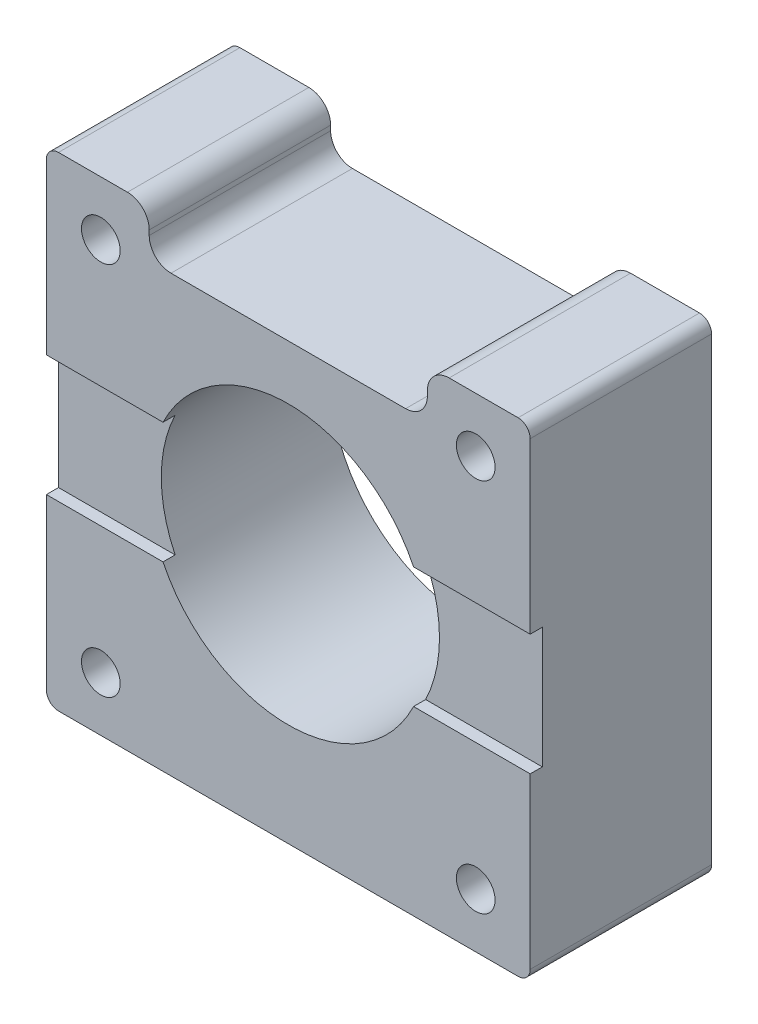
ISO-10303-21;
HEADER;
FILE_DESCRIPTION(('STEP AP214'),'2;1');
FILE_NAME('part.step','',(''),(''),'','','');
FILE_SCHEMA(('AUTOMOTIVE_DESIGN { 1 0 10303 214 1 1 1 1 }'));
ENDSEC;
DATA;
#1=APPLICATION_CONTEXT('core data for automotive mechanical design processes');
#2=APPLICATION_PROTOCOL_DEFINITION('international standard','automotive_design',2000,#1);
#3=PRODUCT_CONTEXT('',#1,'mechanical');
#4=PRODUCT('Part','Part','',(#3));
#5=PRODUCT_RELATED_PRODUCT_CATEGORY('part','',(#4));
#6=PRODUCT_DEFINITION_FORMATION('','',#4);
#7=PRODUCT_DEFINITION_CONTEXT('part definition',#1,'design');
#8=PRODUCT_DEFINITION('design','',#6,#7);
#9=PRODUCT_DEFINITION_SHAPE('','',#8);
#10=(LENGTH_UNIT() NAMED_UNIT(*) SI_UNIT(.MILLI.,.METRE.));
#11=(NAMED_UNIT(*) PLANE_ANGLE_UNIT() SI_UNIT($,.RADIAN.));
#12=(NAMED_UNIT(*) SI_UNIT($,.STERADIAN.) SOLID_ANGLE_UNIT());
#13=UNCERTAINTY_MEASURE_WITH_UNIT(LENGTH_MEASURE(1.E-05),#10,'distance_accuracy_value','');
#14=(GEOMETRIC_REPRESENTATION_CONTEXT(3) GLOBAL_UNCERTAINTY_ASSIGNED_CONTEXT((#13)) GLOBAL_UNIT_ASSIGNED_CONTEXT((#10,
#11,#12)) REPRESENTATION_CONTEXT('',''));
#15=CARTESIAN_POINT('',(0.,0.,0.));
#16=DIRECTION('',(0.,0.,1.));
#17=DIRECTION('',(1.,0.,0.));
#18=AXIS2_PLACEMENT_3D('',#15,#16,#17);
#19=CARTESIAN_POINT('',(-19.,-19.,15.));
#20=DIRECTION('',(0.,0.,1.));
#21=DIRECTION('',(1.,0.,0.));
#22=AXIS2_PLACEMENT_3D('',#19,#20,#21);
#23=PLANE('',#22);
#24=DIRECTION('',(1.,0.,0.));
#25=VECTOR('',#24,1.);
#26=CARTESIAN_POINT('',(-20.,-4.99999999999999,15.));
#27=LINE('',#26,#25);
#28=CARTESIAN_POINT('',(-20.,-4.99999999999999,15.));
#29=VERTEX_POINT('',#28);
#30=CARTESIAN_POINT('',(-10.356157588604,-4.99999999999999,15.));
#31=VERTEX_POINT('',#30);
#32=EDGE_CURVE('E208',#29,#31,#27,.T.);
#33=ORIENTED_EDGE('',*,*,#32,.F.);
#34=DIRECTION('',(0.,-1.,0.));
#35=VECTOR('',#34,1.);
#36=CARTESIAN_POINT('',(-20.,19.,15.));
#37=LINE('',#36,#35);
#38=CARTESIAN_POINT('',(-20.,-19.,15.));
#39=VERTEX_POINT('',#38);
#40=EDGE_CURVE('E288',#29,#39,#37,.T.);
#41=ORIENTED_EDGE('',*,*,#40,.T.);
#42=CARTESIAN_POINT('',(-19.,-19.,15.));
#43=DIRECTION('',(0.,0.,1.));
#44=DIRECTION('',(1.,0.,0.));
#45=AXIS2_PLACEMENT_3D('',#42,#43,#44);
#46=CIRCLE('',#45,1.);
#47=CARTESIAN_POINT('',(-19.,-20.,15.));
#48=VERTEX_POINT('',#47);
#49=EDGE_CURVE('E255',#39,#48,#46,.T.);
#50=ORIENTED_EDGE('',*,*,#49,.T.);
#51=DIRECTION('',(1.,0.,0.));
#52=VECTOR('',#51,1.);
#53=CARTESIAN_POINT('',(-19.,-20.,15.));
#54=LINE('',#53,#52);
#55=CARTESIAN_POINT('',(19.,-20.,15.));
#56=VERTEX_POINT('',#55);
#57=EDGE_CURVE('E258',#48,#56,#54,.T.);
#58=ORIENTED_EDGE('',*,*,#57,.T.);
#59=CARTESIAN_POINT('',(19.,-19.,15.));
#60=DIRECTION('',(0.,0.,1.));
#61=DIRECTION('',(1.,0.,0.));
#62=AXIS2_PLACEMENT_3D('',#59,#60,#61);
#63=CIRCLE('',#62,1.);
#64=CARTESIAN_POINT('',(20.,-19.,15.));
#65=VERTEX_POINT('',#64);
#66=EDGE_CURVE('E261',#56,#65,#63,.T.);
#67=ORIENTED_EDGE('',*,*,#66,.T.);
#68=DIRECTION('',(0.,1.,0.));
#69=VECTOR('',#68,1.);
#70=CARTESIAN_POINT('',(20.,19.,15.));
#71=LINE('',#70,#69);
#72=CARTESIAN_POINT('',(20.,-4.99999999999999,15.));
#73=VERTEX_POINT('',#72);
#74=EDGE_CURVE('E263',#65,#73,#71,.T.);
#75=ORIENTED_EDGE('',*,*,#74,.T.);
#76=CARTESIAN_POINT('',(10.356157588604,-4.99999999999999,15.));
#77=VERTEX_POINT('',#76);
#78=EDGE_CURVE('E392',#77,#73,#27,.T.);
#79=ORIENTED_EDGE('',*,*,#78,.F.);
#80=CARTESIAN_POINT('',(0.,0.,15.));
#81=DIRECTION('',(0.,0.,1.));
#82=DIRECTION('',(1.,0.,0.));
#83=AXIS2_PLACEMENT_3D('',#80,#81,#82);
#84=CIRCLE('',#83,11.5);
#85=EDGE_CURVE('E252',#31,#77,#84,.T.);
#86=ORIENTED_EDGE('',*,*,#85,.F.);
#87=EDGE_LOOP('',(#33,#41,#50,#58,#67,#75,#79,#86));
#88=FACE_BOUND('',#87,.T.);
#89=CARTESIAN_POINT('',(-15.5,-15.5,15.));
#90=DIRECTION('',(0.,0.,1.));
#91=DIRECTION('',(1.,0.,0.));
#92=AXIS2_PLACEMENT_3D('',#89,#90,#91);
#93=CIRCLE('',#92,1.6);
#94=CARTESIAN_POINT('',(-13.9,-15.5,15.));
#95=VERTEX_POINT('',#94);
#96=EDGE_CURVE('E222',#95,#95,#93,.T.);
#97=ORIENTED_EDGE('',*,*,#96,.F.);
#98=EDGE_LOOP('',(#97));
#99=FACE_BOUND('',#98,.T.);
#100=CARTESIAN_POINT('',(15.5,-15.5,15.));
#101=DIRECTION('',(0.,0.,1.));
#102=DIRECTION('',(1.,0.,0.));
#103=AXIS2_PLACEMENT_3D('',#100,#101,#102);
#104=CIRCLE('',#103,1.6);
#105=CARTESIAN_POINT('',(17.1,-15.5,15.));
#106=VERTEX_POINT('',#105);
#107=EDGE_CURVE('E230',#106,#106,#104,.T.);
#108=ORIENTED_EDGE('',*,*,#107,.F.);
#109=EDGE_LOOP('',(#108));
#110=FACE_BOUND('',#109,.T.);
#111=ADVANCED_FACE('F33',(#88,#99,#110),#23,.T.);
#112=DIRECTION('',(-1.,0.,0.));
#113=VECTOR('',#112,1.);
#114=CARTESIAN_POINT('',(-20.,5.00000000000001,15.));
#115=LINE('',#114,#113);
#116=CARTESIAN_POINT('',(20.,5.00000000000001,15.));
#117=VERTEX_POINT('',#116);
#118=CARTESIAN_POINT('',(10.356157588604,5.00000000000001,15.));
#119=VERTEX_POINT('',#118);
#120=EDGE_CURVE('E394',#117,#119,#115,.T.);
#121=ORIENTED_EDGE('',*,*,#120,.F.);
#122=CARTESIAN_POINT('',(20.,19.,15.));
#123=VERTEX_POINT('',#122);
#124=EDGE_CURVE('E213',#117,#123,#71,.T.);
#125=ORIENTED_EDGE('',*,*,#124,.T.);
#126=CARTESIAN_POINT('',(19.,19.,15.));
#127=DIRECTION('',(0.,0.,1.));
#128=DIRECTION('',(1.,0.,0.));
#129=AXIS2_PLACEMENT_3D('',#126,#127,#128);
#130=CIRCLE('',#129,1.);
#131=CARTESIAN_POINT('',(19.,20.,15.));
#132=VERTEX_POINT('',#131);
#133=EDGE_CURVE('E266',#123,#132,#130,.T.);
#134=ORIENTED_EDGE('',*,*,#133,.T.);
#135=DIRECTION('',(-1.,0.,0.));
#136=VECTOR('',#135,1.);
#137=CARTESIAN_POINT('',(13.3,20.,15.));
#138=LINE('',#137,#136);
#139=CARTESIAN_POINT('',(13.3,20.,15.));
#140=VERTEX_POINT('',#139);
#141=EDGE_CURVE('E268',#132,#140,#138,.T.);
#142=ORIENTED_EDGE('',*,*,#141,.T.);
#143=CARTESIAN_POINT('',(13.3,18.2,15.));
#144=DIRECTION('',(0.,0.,1.));
#145=DIRECTION('',(1.,0.,0.));
#146=AXIS2_PLACEMENT_3D('',#143,#144,#145);
#147=CIRCLE('',#146,1.8);
#148=CARTESIAN_POINT('',(11.5,18.2,15.));
#149=VERTEX_POINT('',#148);
#150=EDGE_CURVE('E270',#140,#149,#147,.T.);
#151=ORIENTED_EDGE('',*,*,#150,.T.);
#152=DIRECTION('',(0.,-1.,0.));
#153=VECTOR('',#152,1.);
#154=CARTESIAN_POINT('',(11.5,17.8,15.));
#155=LINE('',#154,#153);
#156=CARTESIAN_POINT('',(11.5,17.8,15.));
#157=VERTEX_POINT('',#156);
#158=EDGE_CURVE('E272',#149,#157,#155,.T.);
#159=ORIENTED_EDGE('',*,*,#158,.T.);
#160=CARTESIAN_POINT('',(9.7,17.8,15.));
#161=DIRECTION('',(0.,0.,-1.));
#162=DIRECTION('',(-1.,0.,0.));
#163=AXIS2_PLACEMENT_3D('',#160,#161,#162);
#164=CIRCLE('',#163,1.8);
#165=CARTESIAN_POINT('',(9.69999999999999,16.,15.));
#166=VERTEX_POINT('',#165);
#167=EDGE_CURVE('E274',#157,#166,#164,.T.);
#168=ORIENTED_EDGE('',*,*,#167,.T.);
#169=DIRECTION('',(-1.,0.,0.));
#170=VECTOR('',#169,1.);
#171=CARTESIAN_POINT('',(-9.69999999999999,16.,15.));
#172=LINE('',#171,#170);
#173=CARTESIAN_POINT('',(-9.69999999999999,16.,15.));
#174=VERTEX_POINT('',#173);
#175=EDGE_CURVE('E276',#166,#174,#172,.T.);
#176=ORIENTED_EDGE('',*,*,#175,.T.);
#177=CARTESIAN_POINT('',(-9.7,17.8,15.));
#178=DIRECTION('',(0.,0.,-1.));
#179=DIRECTION('',(-1.,0.,0.));
#180=AXIS2_PLACEMENT_3D('',#177,#178,#179);
#181=CIRCLE('',#180,1.8);
#182=CARTESIAN_POINT('',(-11.5,17.8,15.));
#183=VERTEX_POINT('',#182);
#184=EDGE_CURVE('E278',#174,#183,#181,.T.);
#185=ORIENTED_EDGE('',*,*,#184,.T.);
#186=DIRECTION('',(0.,1.,0.));
#187=VECTOR('',#186,1.);
#188=CARTESIAN_POINT('',(-11.5,17.8,15.));
#189=LINE('',#188,#187);
#190=CARTESIAN_POINT('',(-11.5,18.2,15.));
#191=VERTEX_POINT('',#190);
#192=EDGE_CURVE('E280',#183,#191,#189,.T.);
#193=ORIENTED_EDGE('',*,*,#192,.T.);
#194=CARTESIAN_POINT('',(-13.3,18.2,15.));
#195=DIRECTION('',(0.,0.,1.));
#196=DIRECTION('',(-1.,0.,0.));
#197=AXIS2_PLACEMENT_3D('',#194,#195,#196);
#198=CIRCLE('',#197,1.8);
#199=CARTESIAN_POINT('',(-13.3,20.,15.));
#200=VERTEX_POINT('',#199);
#201=EDGE_CURVE('E282',#191,#200,#198,.T.);
#202=ORIENTED_EDGE('',*,*,#201,.T.);
#203=DIRECTION('',(-1.,0.,0.));
#204=VECTOR('',#203,1.);
#205=CARTESIAN_POINT('',(-19.,20.,15.));
#206=LINE('',#205,#204);
#207=CARTESIAN_POINT('',(-19.,20.,15.));
#208=VERTEX_POINT('',#207);
#209=EDGE_CURVE('E284',#200,#208,#206,.T.);
#210=ORIENTED_EDGE('',*,*,#209,.T.);
#211=CARTESIAN_POINT('',(-19.,19.,15.));
#212=DIRECTION('',(0.,0.,1.));
#213=DIRECTION('',(-1.,0.,0.));
#214=AXIS2_PLACEMENT_3D('',#211,#212,#213);
#215=CIRCLE('',#214,1.);
#216=CARTESIAN_POINT('',(-20.,19.,15.));
#217=VERTEX_POINT('',#216);
#218=EDGE_CURVE('E286',#208,#217,#215,.T.);
#219=ORIENTED_EDGE('',*,*,#218,.T.);
#220=CARTESIAN_POINT('',(-20.,5.00000000000001,15.));
#221=VERTEX_POINT('',#220);
#222=EDGE_CURVE('E289',#217,#221,#37,.T.);
#223=ORIENTED_EDGE('',*,*,#222,.T.);
#224=CARTESIAN_POINT('',(-10.356157588604,5.00000000000001,15.));
#225=VERTEX_POINT('',#224);
#226=EDGE_CURVE('E396',#225,#221,#115,.T.);
#227=ORIENTED_EDGE('',*,*,#226,.F.);
#228=EDGE_CURVE('E248',#119,#225,#84,.T.);
#229=ORIENTED_EDGE('',*,*,#228,.F.);
#230=EDGE_LOOP('',(#121,#125,#134,#142,#151,#159,#168,#176,#185,#193,#202,#210,#219,#223,#227,#229));
#231=FACE_BOUND('',#230,.T.);
#232=CARTESIAN_POINT('',(-15.5,15.5,15.));
#233=DIRECTION('',(0.,0.,1.));
#234=DIRECTION('',(1.,0.,0.));
#235=AXIS2_PLACEMENT_3D('',#232,#233,#234);
#236=CIRCLE('',#235,1.6);
#237=CARTESIAN_POINT('',(-13.9,15.5,15.));
#238=VERTEX_POINT('',#237);
#239=EDGE_CURVE('E242',#238,#238,#236,.T.);
#240=ORIENTED_EDGE('',*,*,#239,.F.);
#241=EDGE_LOOP('',(#240));
#242=FACE_BOUND('',#241,.T.);
#243=CARTESIAN_POINT('',(15.5,15.5,15.));
#244=DIRECTION('',(0.,0.,1.));
#245=DIRECTION('',(1.,0.,0.));
#246=AXIS2_PLACEMENT_3D('',#243,#244,#245);
#247=CIRCLE('',#246,1.6);
#248=CARTESIAN_POINT('',(17.1,15.5,15.));
#249=VERTEX_POINT('',#248);
#250=EDGE_CURVE('E236',#249,#249,#247,.T.);
#251=ORIENTED_EDGE('',*,*,#250,.F.);
#252=EDGE_LOOP('',(#251));
#253=FACE_BOUND('',#252,.T.);
#254=ADVANCED_FACE('F435',(#231,#242,#253),#23,.T.);
#255=CARTESIAN_POINT('',(-19.,-19.,0.));
#256=DIRECTION('',(0.,0.,1.));
#257=DIRECTION('',(1.,0.,0.));
#258=AXIS2_PLACEMENT_3D('',#255,#256,#257);
#259=PLANE('',#258);
#260=CARTESIAN_POINT('',(15.5,-15.5,0.));
#261=DIRECTION('',(0.,0.,1.));
#262=DIRECTION('',(1.,0.,0.));
#263=AXIS2_PLACEMENT_3D('',#260,#261,#262);
#264=CIRCLE('',#263,1.6);
#265=CARTESIAN_POINT('',(17.1,-15.5,0.));
#266=VERTEX_POINT('',#265);
#267=EDGE_CURVE('E225',#266,#266,#264,.T.);
#268=ORIENTED_EDGE('',*,*,#267,.T.);
#269=EDGE_LOOP('',(#268));
#270=FACE_BOUND('',#269,.T.);
#271=CARTESIAN_POINT('',(-15.5,15.5,0.));
#272=DIRECTION('',(0.,0.,1.));
#273=DIRECTION('',(1.,0.,0.));
#274=AXIS2_PLACEMENT_3D('',#271,#272,#273);
#275=CIRCLE('',#274,1.6);
#276=CARTESIAN_POINT('',(-13.9,15.5,0.));
#277=VERTEX_POINT('',#276);
#278=EDGE_CURVE('E239',#277,#277,#275,.T.);
#279=ORIENTED_EDGE('',*,*,#278,.T.);
#280=EDGE_LOOP('',(#279));
#281=FACE_BOUND('',#280,.T.);
#282=CARTESIAN_POINT('',(-19.,-19.,0.));
#283=DIRECTION('',(0.,0.,1.));
#284=DIRECTION('',(1.,0.,0.));
#285=AXIS2_PLACEMENT_3D('',#282,#283,#284);
#286=CIRCLE('',#285,1.);
#287=CARTESIAN_POINT('',(-20.,-19.,0.));
#288=VERTEX_POINT('',#287);
#289=CARTESIAN_POINT('',(-19.,-20.,0.));
#290=VERTEX_POINT('',#289);
#291=EDGE_CURVE('E251',#288,#290,#286,.T.);
#292=ORIENTED_EDGE('',*,*,#291,.F.);
#293=DIRECTION('',(0.,-1.,0.));
#294=VECTOR('',#293,1.);
#295=CARTESIAN_POINT('',(-20.,19.,0.));
#296=LINE('',#295,#294);
#297=CARTESIAN_POINT('',(-20.,19.,0.));
#298=VERTEX_POINT('',#297);
#299=EDGE_CURVE('E259',#298,#288,#296,.T.);
#300=ORIENTED_EDGE('',*,*,#299,.F.);
#301=CARTESIAN_POINT('',(-19.,19.,0.));
#302=DIRECTION('',(0.,0.,1.));
#303=DIRECTION('',(-1.,0.,0.));
#304=AXIS2_PLACEMENT_3D('',#301,#302,#303);
#305=CIRCLE('',#304,1.);
#306=CARTESIAN_POINT('',(-19.,20.,0.));
#307=VERTEX_POINT('',#306);
#308=EDGE_CURVE('E321',#307,#298,#305,.T.);
#309=ORIENTED_EDGE('',*,*,#308,.F.);
#310=DIRECTION('',(-1.,0.,0.));
#311=VECTOR('',#310,1.);
#312=CARTESIAN_POINT('',(-19.,20.,0.));
#313=LINE('',#312,#311);
#314=CARTESIAN_POINT('',(-13.3,20.,0.));
#315=VERTEX_POINT('',#314);
#316=EDGE_CURVE('E319',#315,#307,#313,.T.);
#317=ORIENTED_EDGE('',*,*,#316,.F.);
#318=CARTESIAN_POINT('',(-13.3,18.2,0.));
#319=DIRECTION('',(0.,0.,1.));
#320=DIRECTION('',(-1.,0.,0.));
#321=AXIS2_PLACEMENT_3D('',#318,#319,#320);
#322=CIRCLE('',#321,1.8);
#323=CARTESIAN_POINT('',(-11.5,18.2,0.));
#324=VERTEX_POINT('',#323);
#325=EDGE_CURVE('E317',#324,#315,#322,.T.);
#326=ORIENTED_EDGE('',*,*,#325,.F.);
#327=DIRECTION('',(0.,1.,0.));
#328=VECTOR('',#327,1.);
#329=CARTESIAN_POINT('',(-11.5,17.8,0.));
#330=LINE('',#329,#328);
#331=CARTESIAN_POINT('',(-11.5,17.8,0.));
#332=VERTEX_POINT('',#331);
#333=EDGE_CURVE('E315',#332,#324,#330,.T.);
#334=ORIENTED_EDGE('',*,*,#333,.F.);
#335=CARTESIAN_POINT('',(-9.7,17.8,0.));
#336=DIRECTION('',(0.,0.,-1.));
#337=DIRECTION('',(-1.,0.,0.));
#338=AXIS2_PLACEMENT_3D('',#335,#336,#337);
#339=CIRCLE('',#338,1.8);
#340=CARTESIAN_POINT('',(-9.69999999999999,16.,0.));
#341=VERTEX_POINT('',#340);
#342=EDGE_CURVE('E313',#341,#332,#339,.T.);
#343=ORIENTED_EDGE('',*,*,#342,.F.);
#344=DIRECTION('',(-1.,0.,0.));
#345=VECTOR('',#344,1.);
#346=CARTESIAN_POINT('',(-9.69999999999999,16.,0.));
#347=LINE('',#346,#345);
#348=CARTESIAN_POINT('',(9.69999999999999,16.,0.));
#349=VERTEX_POINT('',#348);
#350=EDGE_CURVE('E311',#349,#341,#347,.T.);
#351=ORIENTED_EDGE('',*,*,#350,.F.);
#352=CARTESIAN_POINT('',(9.7,17.8,0.));
#353=DIRECTION('',(0.,0.,-1.));
#354=DIRECTION('',(-1.,0.,0.));
#355=AXIS2_PLACEMENT_3D('',#352,#353,#354);
#356=CIRCLE('',#355,1.8);
#357=CARTESIAN_POINT('',(11.5,17.8,0.));
#358=VERTEX_POINT('',#357);
#359=EDGE_CURVE('E309',#358,#349,#356,.T.);
#360=ORIENTED_EDGE('',*,*,#359,.F.);
#361=DIRECTION('',(0.,-1.,0.));
#362=VECTOR('',#361,1.);
#363=CARTESIAN_POINT('',(11.5,17.8,0.));
#364=LINE('',#363,#362);
#365=CARTESIAN_POINT('',(11.5,18.2,0.));
#366=VERTEX_POINT('',#365);
#367=EDGE_CURVE('E307',#366,#358,#364,.T.);
#368=ORIENTED_EDGE('',*,*,#367,.F.);
#369=CARTESIAN_POINT('',(13.3,18.2,0.));
#370=DIRECTION('',(0.,0.,1.));
#371=DIRECTION('',(1.,0.,0.));
#372=AXIS2_PLACEMENT_3D('',#369,#370,#371);
#373=CIRCLE('',#372,1.8);
#374=CARTESIAN_POINT('',(13.3,20.,0.));
#375=VERTEX_POINT('',#374);
#376=EDGE_CURVE('E305',#375,#366,#373,.T.);
#377=ORIENTED_EDGE('',*,*,#376,.F.);
#378=DIRECTION('',(-1.,0.,0.));
#379=VECTOR('',#378,1.);
#380=CARTESIAN_POINT('',(13.3,20.,0.));
#381=LINE('',#380,#379);
#382=CARTESIAN_POINT('',(19.,20.,0.));
#383=VERTEX_POINT('',#382);
#384=EDGE_CURVE('E303',#383,#375,#381,.T.);
#385=ORIENTED_EDGE('',*,*,#384,.F.);
#386=CARTESIAN_POINT('',(19.,19.,0.));
#387=DIRECTION('',(0.,0.,1.));
#388=DIRECTION('',(1.,0.,0.));
#389=AXIS2_PLACEMENT_3D('',#386,#387,#388);
#390=CIRCLE('',#389,1.);
#391=CARTESIAN_POINT('',(20.,19.,0.));
#392=VERTEX_POINT('',#391);
#393=EDGE_CURVE('E301',#392,#383,#390,.T.);
#394=ORIENTED_EDGE('',*,*,#393,.F.);
#395=DIRECTION('',(0.,1.,0.));
#396=VECTOR('',#395,1.);
#397=CARTESIAN_POINT('',(20.,19.,0.));
#398=LINE('',#397,#396);
#399=CARTESIAN_POINT('',(20.,-19.,0.));
#400=VERTEX_POINT('',#399);
#401=EDGE_CURVE('E299',#400,#392,#398,.T.);
#402=ORIENTED_EDGE('',*,*,#401,.F.);
#403=CARTESIAN_POINT('',(19.,-19.,0.));
#404=DIRECTION('',(0.,0.,1.));
#405=DIRECTION('',(1.,0.,0.));
#406=AXIS2_PLACEMENT_3D('',#403,#404,#405);
#407=CIRCLE('',#406,1.);
#408=CARTESIAN_POINT('',(19.,-20.,0.));
#409=VERTEX_POINT('',#408);
#410=EDGE_CURVE('E297',#409,#400,#407,.T.);
#411=ORIENTED_EDGE('',*,*,#410,.F.);
#412=DIRECTION('',(1.,0.,0.));
#413=VECTOR('',#412,1.);
#414=CARTESIAN_POINT('',(-19.,-20.,0.));
#415=LINE('',#414,#413);
#416=EDGE_CURVE('E295',#290,#409,#415,.T.);
#417=ORIENTED_EDGE('',*,*,#416,.F.);
#418=EDGE_LOOP('',(#292,#300,#309,#317,#326,#334,#343,#351,#360,#368,#377,#385,#394,#402,#411,#417));
#419=FACE_BOUND('',#418,.T.);
#420=CARTESIAN_POINT('',(0.,0.,0.));
#421=DIRECTION('',(0.,0.,1.));
#422=DIRECTION('',(1.,0.,0.));
#423=AXIS2_PLACEMENT_3D('',#420,#421,#422);
#424=CIRCLE('',#423,11.5);
#425=CARTESIAN_POINT('',(11.5,0.,0.));
#426=VERTEX_POINT('',#425);
#427=EDGE_CURVE('E245',#426,#426,#424,.T.);
#428=ORIENTED_EDGE('',*,*,#427,.T.);
#429=EDGE_LOOP('',(#428));
#430=FACE_BOUND('',#429,.T.);
#431=CARTESIAN_POINT('',(15.5,15.5,0.));
#432=DIRECTION('',(0.,0.,1.));
#433=DIRECTION('',(1.,0.,0.));
#434=AXIS2_PLACEMENT_3D('',#431,#432,#433);
#435=CIRCLE('',#434,1.6);
#436=CARTESIAN_POINT('',(17.1,15.5,0.));
#437=VERTEX_POINT('',#436);
#438=EDGE_CURVE('E233',#437,#437,#435,.T.);
#439=ORIENTED_EDGE('',*,*,#438,.T.);
#440=EDGE_LOOP('',(#439));
#441=FACE_BOUND('',#440,.T.);
#442=CARTESIAN_POINT('',(-15.5,-15.5,0.));
#443=DIRECTION('',(0.,0.,1.));
#444=DIRECTION('',(1.,0.,0.));
#445=AXIS2_PLACEMENT_3D('',#442,#443,#444);
#446=CIRCLE('',#445,1.6);
#447=CARTESIAN_POINT('',(-13.9,-15.5,0.));
#448=VERTEX_POINT('',#447);
#449=EDGE_CURVE('E226',#448,#448,#446,.T.);
#450=ORIENTED_EDGE('',*,*,#449,.T.);
#451=EDGE_LOOP('',(#450));
#452=FACE_BOUND('',#451,.T.);
#453=ADVANCED_FACE('F421',(#270,#281,#419,#430,#441,#452),#259,.F.);
#454=CARTESIAN_POINT('',(-19.,-19.,15.));
#455=DIRECTION('',(0.,0.,-1.));
#456=DIRECTION('',(-1.,0.,0.));
#457=AXIS2_PLACEMENT_3D('',#454,#455,#456);
#458=CYLINDRICAL_SURFACE('',#457,1.);
#459=ORIENTED_EDGE('',*,*,#291,.T.);
#460=DIRECTION('',(0.,0.,-1.));
#461=VECTOR('',#460,1.);
#462=CARTESIAN_POINT('',(-19.,-20.,15.));
#463=LINE('',#462,#461);
#464=EDGE_CURVE('E368',#48,#290,#463,.T.);
#465=ORIENTED_EDGE('',*,*,#464,.F.);
#466=ORIENTED_EDGE('',*,*,#49,.F.);
#467=DIRECTION('',(0.,0.,-1.));
#468=VECTOR('',#467,1.);
#469=CARTESIAN_POINT('',(-20.,-19.,15.));
#470=LINE('',#469,#468);
#471=EDGE_CURVE('E292',#39,#288,#470,.T.);
#472=ORIENTED_EDGE('',*,*,#471,.T.);
#473=EDGE_LOOP('',(#459,#465,#466,#472));
#474=FACE_BOUND('',#473,.T.);
#475=ADVANCED_FACE('F35',(#474),#458,.T.);
#476=CARTESIAN_POINT('',(-19.,-20.,15.));
#477=DIRECTION('',(0.,1.,0.));
#478=DIRECTION('',(0.,0.,1.));
#479=AXIS2_PLACEMENT_3D('',#476,#477,#478);
#480=PLANE('',#479);
#481=ORIENTED_EDGE('',*,*,#416,.T.);
#482=DIRECTION('',(0.,0.,-1.));
#483=VECTOR('',#482,1.);
#484=CARTESIAN_POINT('',(19.,-20.,15.));
#485=LINE('',#484,#483);
#486=EDGE_CURVE('E365',#56,#409,#485,.T.);
#487=ORIENTED_EDGE('',*,*,#486,.F.);
#488=ORIENTED_EDGE('',*,*,#57,.F.);
#489=ORIENTED_EDGE('',*,*,#464,.T.);
#490=EDGE_LOOP('',(#481,#487,#488,#489));
#491=FACE_BOUND('',#490,.T.);
#492=ADVANCED_FACE('F412',(#491),#480,.F.);
#493=CARTESIAN_POINT('',(19.,-19.,15.));
#494=DIRECTION('',(0.,0.,-1.));
#495=DIRECTION('',(-1.,0.,0.));
#496=AXIS2_PLACEMENT_3D('',#493,#494,#495);
#497=CYLINDRICAL_SURFACE('',#496,1.);
#498=ORIENTED_EDGE('',*,*,#410,.T.);
#499=DIRECTION('',(0.,0.,-1.));
#500=VECTOR('',#499,1.);
#501=CARTESIAN_POINT('',(20.,-19.,15.));
#502=LINE('',#501,#500);
#503=EDGE_CURVE('E362',#65,#400,#502,.T.);
#504=ORIENTED_EDGE('',*,*,#503,.F.);
#505=ORIENTED_EDGE('',*,*,#66,.F.);
#506=ORIENTED_EDGE('',*,*,#486,.T.);
#507=EDGE_LOOP('',(#498,#504,#505,#506));
#508=FACE_BOUND('',#507,.T.);
#509=ADVANCED_FACE('F417',(#508),#497,.T.);
#510=CARTESIAN_POINT('',(20.,19.,15.));
#511=DIRECTION('',(-1.,0.,0.));
#512=DIRECTION('',(0.,0.,1.));
#513=AXIS2_PLACEMENT_3D('',#510,#511,#512);
#514=PLANE('',#513);
#515=DIRECTION('',(0.,1.,0.));
#516=VECTOR('',#515,1.);
#517=CARTESIAN_POINT('',(20.,-4.99999999999999,14.));
#518=LINE('',#517,#516);
#519=CARTESIAN_POINT('',(20.,-4.99999999999999,14.));
#520=VERTEX_POINT('',#519);
#521=CARTESIAN_POINT('',(20.,5.00000000000001,14.));
#522=VERTEX_POINT('',#521);
#523=EDGE_CURVE('E201',#520,#522,#518,.T.);
#524=ORIENTED_EDGE('',*,*,#523,.F.);
#525=DIRECTION('',(0.,0.,1.));
#526=VECTOR('',#525,1.);
#527=CARTESIAN_POINT('',(20.,-4.99999999999999,14.));
#528=LINE('',#527,#526);
#529=EDGE_CURVE('E229',#520,#73,#528,.T.);
#530=ORIENTED_EDGE('',*,*,#529,.T.);
#531=ORIENTED_EDGE('',*,*,#74,.F.);
#532=ORIENTED_EDGE('',*,*,#503,.T.);
#533=ORIENTED_EDGE('',*,*,#401,.T.);
#534=DIRECTION('',(0.,0.,-1.));
#535=VECTOR('',#534,1.);
#536=CARTESIAN_POINT('',(20.,19.,15.));
#537=LINE('',#536,#535);
#538=EDGE_CURVE('E359',#123,#392,#537,.T.);
#539=ORIENTED_EDGE('',*,*,#538,.F.);
#540=ORIENTED_EDGE('',*,*,#124,.F.);
#541=DIRECTION('',(0.,0.,1.));
#542=VECTOR('',#541,1.);
#543=CARTESIAN_POINT('',(20.,5.00000000000001,14.));
#544=LINE('',#543,#542);
#545=EDGE_CURVE('E193',#522,#117,#544,.T.);
#546=ORIENTED_EDGE('',*,*,#545,.F.);
#547=EDGE_LOOP('',(#524,#530,#531,#532,#533,#539,#540,#546));
#548=FACE_BOUND('',#547,.T.);
#549=ADVANCED_FACE('F211',(#548),#514,.F.);
#550=CARTESIAN_POINT('',(19.,19.,15.));
#551=DIRECTION('',(0.,0.,-1.));
#552=DIRECTION('',(-1.,0.,0.));
#553=AXIS2_PLACEMENT_3D('',#550,#551,#552);
#554=CYLINDRICAL_SURFACE('',#553,1.);
#555=ORIENTED_EDGE('',*,*,#393,.T.);
#556=DIRECTION('',(0.,0.,-1.));
#557=VECTOR('',#556,1.);
#558=CARTESIAN_POINT('',(19.,20.,15.));
#559=LINE('',#558,#557);
#560=EDGE_CURVE('E356',#132,#383,#559,.T.);
#561=ORIENTED_EDGE('',*,*,#560,.F.);
#562=ORIENTED_EDGE('',*,*,#133,.F.);
#563=ORIENTED_EDGE('',*,*,#538,.T.);
#564=EDGE_LOOP('',(#555,#561,#562,#563));
#565=FACE_BOUND('',#564,.T.);
#566=ADVANCED_FACE('F427',(#565),#554,.T.);
#567=CARTESIAN_POINT('',(13.3,20.,15.));
#568=DIRECTION('',(0.,-1.,0.));
#569=DIRECTION('',(0.,0.,-1.));
#570=AXIS2_PLACEMENT_3D('',#567,#568,#569);
#571=PLANE('',#570);
#572=ORIENTED_EDGE('',*,*,#384,.T.);
#573=DIRECTION('',(0.,0.,-1.));
#574=VECTOR('',#573,1.);
#575=CARTESIAN_POINT('',(13.3,20.,15.));
#576=LINE('',#575,#574);
#577=EDGE_CURVE('E353',#140,#375,#576,.T.);
#578=ORIENTED_EDGE('',*,*,#577,.F.);
#579=ORIENTED_EDGE('',*,*,#141,.F.);
#580=ORIENTED_EDGE('',*,*,#560,.T.);
#581=EDGE_LOOP('',(#572,#578,#579,#580));
#582=FACE_BOUND('',#581,.T.);
#583=ADVANCED_FACE('F431',(#582),#571,.F.);
#584=CARTESIAN_POINT('',(13.3,18.2,15.));
#585=DIRECTION('',(0.,0.,-1.));
#586=DIRECTION('',(-1.,0.,0.));
#587=AXIS2_PLACEMENT_3D('',#584,#585,#586);
#588=CYLINDRICAL_SURFACE('',#587,1.8);
#589=ORIENTED_EDGE('',*,*,#376,.T.);
#590=DIRECTION('',(0.,0.,-1.));
#591=VECTOR('',#590,1.);
#592=CARTESIAN_POINT('',(11.5,18.2,15.));
#593=LINE('',#592,#591);
#594=EDGE_CURVE('E350',#149,#366,#593,.T.);
#595=ORIENTED_EDGE('',*,*,#594,.F.);
#596=ORIENTED_EDGE('',*,*,#150,.F.);
#597=ORIENTED_EDGE('',*,*,#577,.T.);
#598=EDGE_LOOP('',(#589,#595,#596,#597));
#599=FACE_BOUND('',#598,.T.);
#600=ADVANCED_FACE('F488',(#599),#588,.T.);
#601=CARTESIAN_POINT('',(11.5,17.8,15.));
#602=DIRECTION('',(1.,0.,0.));
#603=DIRECTION('',(0.,0.,-1.));
#604=AXIS2_PLACEMENT_3D('',#601,#602,#603);
#605=PLANE('',#604);
#606=ORIENTED_EDGE('',*,*,#367,.T.);
#607=DIRECTION('',(0.,0.,-1.));
#608=VECTOR('',#607,1.);
#609=CARTESIAN_POINT('',(11.5,17.8,15.));
#610=LINE('',#609,#608);
#611=EDGE_CURVE('E347',#157,#358,#610,.T.);
#612=ORIENTED_EDGE('',*,*,#611,.F.);
#613=ORIENTED_EDGE('',*,*,#158,.F.);
#614=ORIENTED_EDGE('',*,*,#594,.T.);
#615=EDGE_LOOP('',(#606,#612,#613,#614));
#616=FACE_BOUND('',#615,.T.);
#617=ADVANCED_FACE('F486',(#616),#605,.F.);
#618=CARTESIAN_POINT('',(9.7,17.8,15.));
#619=DIRECTION('',(0.,0.,-1.));
#620=DIRECTION('',(-1.,0.,0.));
#621=AXIS2_PLACEMENT_3D('',#618,#619,#620);
#622=CYLINDRICAL_SURFACE('',#621,1.8);
#623=ORIENTED_EDGE('',*,*,#359,.T.);
#624=DIRECTION('',(0.,0.,-1.));
#625=VECTOR('',#624,1.);
#626=CARTESIAN_POINT('',(9.69999999999999,16.,15.));
#627=LINE('',#626,#625);
#628=EDGE_CURVE('E344',#166,#349,#627,.T.);
#629=ORIENTED_EDGE('',*,*,#628,.F.);
#630=ORIENTED_EDGE('',*,*,#167,.F.);
#631=ORIENTED_EDGE('',*,*,#611,.T.);
#632=EDGE_LOOP('',(#623,#629,#630,#631));
#633=FACE_BOUND('',#632,.T.);
#634=ADVANCED_FACE('F481',(#633),#622,.F.);
#635=CARTESIAN_POINT('',(-9.69999999999999,16.,15.));
#636=DIRECTION('',(0.,-1.,0.));
#637=DIRECTION('',(0.,0.,-1.));
#638=AXIS2_PLACEMENT_3D('',#635,#636,#637);
#639=PLANE('',#638);
#640=ORIENTED_EDGE('',*,*,#350,.T.);
#641=DIRECTION('',(0.,0.,-1.));
#642=VECTOR('',#641,1.);
#643=CARTESIAN_POINT('',(-9.69999999999999,16.,15.));
#644=LINE('',#643,#642);
#645=EDGE_CURVE('E341',#174,#341,#644,.T.);
#646=ORIENTED_EDGE('',*,*,#645,.F.);
#647=ORIENTED_EDGE('',*,*,#175,.F.);
#648=ORIENTED_EDGE('',*,*,#628,.T.);
#649=EDGE_LOOP('',(#640,#646,#647,#648));
#650=FACE_BOUND('',#649,.T.);
#651=ADVANCED_FACE('F476',(#650),#639,.F.);
#652=CARTESIAN_POINT('',(-9.7,17.8,15.));
#653=DIRECTION('',(0.,0.,-1.));
#654=DIRECTION('',(-1.,0.,0.));
#655=AXIS2_PLACEMENT_3D('',#652,#653,#654);
#656=CYLINDRICAL_SURFACE('',#655,1.8);
#657=ORIENTED_EDGE('',*,*,#342,.T.);
#658=DIRECTION('',(0.,0.,-1.));
#659=VECTOR('',#658,1.);
#660=CARTESIAN_POINT('',(-11.5,17.8,15.));
#661=LINE('',#660,#659);
#662=EDGE_CURVE('E338',#183,#332,#661,.T.);
#663=ORIENTED_EDGE('',*,*,#662,.F.);
#664=ORIENTED_EDGE('',*,*,#184,.F.);
#665=ORIENTED_EDGE('',*,*,#645,.T.);
#666=EDGE_LOOP('',(#657,#663,#664,#665));
#667=FACE_BOUND('',#666,.T.);
#668=ADVANCED_FACE('F472',(#667),#656,.F.);
#669=CARTESIAN_POINT('',(-11.5,17.8,15.));
#670=DIRECTION('',(-1.,0.,0.));
#671=DIRECTION('',(0.,0.,1.));
#672=AXIS2_PLACEMENT_3D('',#669,#670,#671);
#673=PLANE('',#672);
#674=ORIENTED_EDGE('',*,*,#333,.T.);
#675=DIRECTION('',(0.,0.,-1.));
#676=VECTOR('',#675,1.);
#677=CARTESIAN_POINT('',(-11.5,18.2,15.));
#678=LINE('',#677,#676);
#679=EDGE_CURVE('E335',#191,#324,#678,.T.);
#680=ORIENTED_EDGE('',*,*,#679,.F.);
#681=ORIENTED_EDGE('',*,*,#192,.F.);
#682=ORIENTED_EDGE('',*,*,#662,.T.);
#683=EDGE_LOOP('',(#674,#680,#681,#682));
#684=FACE_BOUND('',#683,.T.);
#685=ADVANCED_FACE('F467',(#684),#673,.F.);
#686=CARTESIAN_POINT('',(-13.3,18.2,15.));
#687=DIRECTION('',(0.,0.,-1.));
#688=DIRECTION('',(-1.,0.,0.));
#689=AXIS2_PLACEMENT_3D('',#686,#687,#688);
#690=CYLINDRICAL_SURFACE('',#689,1.8);
#691=ORIENTED_EDGE('',*,*,#325,.T.);
#692=DIRECTION('',(0.,0.,-1.));
#693=VECTOR('',#692,1.);
#694=CARTESIAN_POINT('',(-13.3,20.,15.));
#695=LINE('',#694,#693);
#696=EDGE_CURVE('E332',#200,#315,#695,.T.);
#697=ORIENTED_EDGE('',*,*,#696,.F.);
#698=ORIENTED_EDGE('',*,*,#201,.F.);
#699=ORIENTED_EDGE('',*,*,#679,.T.);
#700=EDGE_LOOP('',(#691,#697,#698,#699));
#701=FACE_BOUND('',#700,.T.);
#702=ADVANCED_FACE('F461',(#701),#690,.T.);
#703=CARTESIAN_POINT('',(-19.,20.,15.));
#704=DIRECTION('',(0.,-1.,0.));
#705=DIRECTION('',(0.,0.,-1.));
#706=AXIS2_PLACEMENT_3D('',#703,#704,#705);
#707=PLANE('',#706);
#708=ORIENTED_EDGE('',*,*,#316,.T.);
#709=DIRECTION('',(0.,0.,-1.));
#710=VECTOR('',#709,1.);
#711=CARTESIAN_POINT('',(-19.,20.,15.));
#712=LINE('',#711,#710);
#713=EDGE_CURVE('E329',#208,#307,#712,.T.);
#714=ORIENTED_EDGE('',*,*,#713,.F.);
#715=ORIENTED_EDGE('',*,*,#209,.F.);
#716=ORIENTED_EDGE('',*,*,#696,.T.);
#717=EDGE_LOOP('',(#708,#714,#715,#716));
#718=FACE_BOUND('',#717,.T.);
#719=ADVANCED_FACE('F457',(#718),#707,.F.);
#720=CARTESIAN_POINT('',(-19.,19.,15.));
#721=DIRECTION('',(0.,0.,-1.));
#722=DIRECTION('',(-1.,0.,0.));
#723=AXIS2_PLACEMENT_3D('',#720,#721,#722);
#724=CYLINDRICAL_SURFACE('',#723,1.);
#725=ORIENTED_EDGE('',*,*,#308,.T.);
#726=DIRECTION('',(0.,0.,-1.));
#727=VECTOR('',#726,1.);
#728=CARTESIAN_POINT('',(-20.,19.,15.));
#729=LINE('',#728,#727);
#730=EDGE_CURVE('E326',#217,#298,#729,.T.);
#731=ORIENTED_EDGE('',*,*,#730,.F.);
#732=ORIENTED_EDGE('',*,*,#218,.F.);
#733=ORIENTED_EDGE('',*,*,#713,.T.);
#734=EDGE_LOOP('',(#725,#731,#732,#733));
#735=FACE_BOUND('',#734,.T.);
#736=ADVANCED_FACE('F453',(#735),#724,.T.);
#737=CARTESIAN_POINT('',(-20.,19.,15.));
#738=DIRECTION('',(1.,0.,0.));
#739=DIRECTION('',(0.,0.,-1.));
#740=AXIS2_PLACEMENT_3D('',#737,#738,#739);
#741=PLANE('',#740);
#742=ORIENTED_EDGE('',*,*,#40,.F.);
#743=DIRECTION('',(0.,0.,1.));
#744=VECTOR('',#743,1.);
#745=CARTESIAN_POINT('',(-20.,-4.99999999999999,14.));
#746=LINE('',#745,#744);
#747=CARTESIAN_POINT('',(-20.,-4.99999999999999,14.));
#748=VERTEX_POINT('',#747);
#749=EDGE_CURVE('E217',#748,#29,#746,.T.);
#750=ORIENTED_EDGE('',*,*,#749,.F.);
#751=DIRECTION('',(0.,-1.,0.));
#752=VECTOR('',#751,1.);
#753=CARTESIAN_POINT('',(-20.,-4.99999999999999,14.));
#754=LINE('',#753,#752);
#755=CARTESIAN_POINT('',(-20.,5.00000000000001,14.));
#756=VERTEX_POINT('',#755);
#757=EDGE_CURVE('E197',#756,#748,#754,.T.);
#758=ORIENTED_EDGE('',*,*,#757,.F.);
#759=DIRECTION('',(0.,0.,1.));
#760=VECTOR('',#759,1.);
#761=CARTESIAN_POINT('',(-20.,5.00000000000001,14.));
#762=LINE('',#761,#760);
#763=EDGE_CURVE('E214',#756,#221,#762,.T.);
#764=ORIENTED_EDGE('',*,*,#763,.T.);
#765=ORIENTED_EDGE('',*,*,#222,.F.);
#766=ORIENTED_EDGE('',*,*,#730,.T.);
#767=ORIENTED_EDGE('',*,*,#299,.T.);
#768=ORIENTED_EDGE('',*,*,#471,.F.);
#769=EDGE_LOOP('',(#742,#750,#758,#764,#765,#766,#767,#768));
#770=FACE_BOUND('',#769,.T.);
#771=ADVANCED_FACE('F404',(#770),#741,.F.);
#772=CARTESIAN_POINT('',(0.,0.,15.));
#773=DIRECTION('',(0.,0.,-1.));
#774=DIRECTION('',(-1.,0.,0.));
#775=AXIS2_PLACEMENT_3D('',#772,#773,#774);
#776=CYLINDRICAL_SURFACE('',#775,11.5);
#777=DIRECTION('',(0.,0.,-1.));
#778=VECTOR('',#777,1.);
#779=CARTESIAN_POINT('',(10.356157588604,-4.99999999999999,15.));
#780=LINE('',#779,#778);
#781=CARTESIAN_POINT('',(10.356157588604,-4.99999999999999,14.));
#782=VERTEX_POINT('',#781);
#783=EDGE_CURVE('E11',#782,#77,#780,.F.);
#784=ORIENTED_EDGE('',*,*,#783,.F.);
#785=CARTESIAN_POINT('',(0.,0.,14.));
#786=DIRECTION('',(0.,0.,-1.));
#787=DIRECTION('',(-1.,0.,0.));
#788=AXIS2_PLACEMENT_3D('',#785,#786,#787);
#789=CIRCLE('',#788,11.5);
#790=CARTESIAN_POINT('',(10.356157588604,5.00000000000001,14.));
#791=VERTEX_POINT('',#790);
#792=EDGE_CURVE('E374',#791,#782,#789,.T.);
#793=ORIENTED_EDGE('',*,*,#792,.F.);
#794=DIRECTION('',(0.,0.,-1.));
#795=VECTOR('',#794,1.);
#796=CARTESIAN_POINT('',(10.356157588604,5.00000000000001,15.));
#797=LINE('',#796,#795);
#798=EDGE_CURVE('E41',#119,#791,#797,.T.);
#799=ORIENTED_EDGE('',*,*,#798,.F.);
#800=ORIENTED_EDGE('',*,*,#228,.T.);
#801=DIRECTION('',(0.,0.,-1.));
#802=VECTOR('',#801,1.);
#803=CARTESIAN_POINT('',(-10.356157588604,5.00000000000001,15.));
#804=LINE('',#803,#802);
#805=CARTESIAN_POINT('',(-10.356157588604,5.00000000000001,14.));
#806=VERTEX_POINT('',#805);
#807=EDGE_CURVE('E373',#806,#225,#804,.F.);
#808=ORIENTED_EDGE('',*,*,#807,.F.);
#809=CARTESIAN_POINT('',(-10.356157588604,-4.99999999999999,14.));
#810=VERTEX_POINT('',#809);
#811=EDGE_CURVE('E371',#810,#806,#789,.T.);
#812=ORIENTED_EDGE('',*,*,#811,.F.);
#813=DIRECTION('',(0.,0.,-1.));
#814=VECTOR('',#813,1.);
#815=CARTESIAN_POINT('',(-10.356157588604,-4.99999999999999,15.));
#816=LINE('',#815,#814);
#817=EDGE_CURVE('E376',#31,#810,#816,.T.);
#818=ORIENTED_EDGE('',*,*,#817,.F.);
#819=ORIENTED_EDGE('',*,*,#85,.T.);
#820=EDGE_LOOP('',(#784,#793,#799,#800,#808,#812,#818,#819));
#821=FACE_BOUND('',#820,.T.);
#822=ORIENTED_EDGE('',*,*,#427,.F.);
#823=EDGE_LOOP('',(#822));
#824=FACE_BOUND('',#823,.T.);
#825=ADVANCED_FACE('F383',(#821,#824),#776,.F.);
#826=CARTESIAN_POINT('',(-15.5,15.5,15.));
#827=DIRECTION('',(0.,0.,-1.));
#828=DIRECTION('',(-1.,0.,0.));
#829=AXIS2_PLACEMENT_3D('',#826,#827,#828);
#830=CYLINDRICAL_SURFACE('',#829,1.6);
#831=ORIENTED_EDGE('',*,*,#239,.T.);
#832=EDGE_LOOP('',(#831));
#833=FACE_BOUND('',#832,.T.);
#834=ORIENTED_EDGE('',*,*,#278,.F.);
#835=EDGE_LOOP('',(#834));
#836=FACE_BOUND('',#835,.T.);
#837=ADVANCED_FACE('F563',(#833,#836),#830,.F.);
#838=CARTESIAN_POINT('',(15.5,15.5,15.));
#839=DIRECTION('',(0.,0.,-1.));
#840=DIRECTION('',(-1.,0.,0.));
#841=AXIS2_PLACEMENT_3D('',#838,#839,#840);
#842=CYLINDRICAL_SURFACE('',#841,1.6);
#843=ORIENTED_EDGE('',*,*,#250,.T.);
#844=EDGE_LOOP('',(#843));
#845=FACE_BOUND('',#844,.T.);
#846=ORIENTED_EDGE('',*,*,#438,.F.);
#847=EDGE_LOOP('',(#846));
#848=FACE_BOUND('',#847,.T.);
#849=ADVANCED_FACE('F569',(#845,#848),#842,.F.);
#850=CARTESIAN_POINT('',(15.5,-15.5,15.));
#851=DIRECTION('',(0.,0.,-1.));
#852=DIRECTION('',(-1.,0.,0.));
#853=AXIS2_PLACEMENT_3D('',#850,#851,#852);
#854=CYLINDRICAL_SURFACE('',#853,1.6);
#855=ORIENTED_EDGE('',*,*,#107,.T.);
#856=EDGE_LOOP('',(#855));
#857=FACE_BOUND('',#856,.T.);
#858=ORIENTED_EDGE('',*,*,#267,.F.);
#859=EDGE_LOOP('',(#858));
#860=FACE_BOUND('',#859,.T.);
#861=ADVANCED_FACE('F576',(#857,#860),#854,.F.);
#862=CARTESIAN_POINT('',(-15.5,-15.5,15.));
#863=DIRECTION('',(0.,0.,-1.));
#864=DIRECTION('',(-1.,0.,0.));
#865=AXIS2_PLACEMENT_3D('',#862,#863,#864);
#866=CYLINDRICAL_SURFACE('',#865,1.6);
#867=ORIENTED_EDGE('',*,*,#96,.T.);
#868=EDGE_LOOP('',(#867));
#869=FACE_BOUND('',#868,.T.);
#870=ORIENTED_EDGE('',*,*,#449,.F.);
#871=EDGE_LOOP('',(#870));
#872=FACE_BOUND('',#871,.T.);
#873=ADVANCED_FACE('F584',(#869,#872),#866,.F.);
#874=CARTESIAN_POINT('',(0.,0.,14.));
#875=DIRECTION('',(0.,0.,-1.));
#876=DIRECTION('',(-1.,0.,0.));
#877=AXIS2_PLACEMENT_3D('',#874,#875,#876);
#878=PLANE('',#877);
#879=ORIENTED_EDGE('',*,*,#811,.T.);
#880=DIRECTION('',(-1.,0.,0.));
#881=VECTOR('',#880,1.);
#882=CARTESIAN_POINT('',(-20.,5.00000000000001,14.));
#883=LINE('',#882,#881);
#884=EDGE_CURVE('E198',#806,#756,#883,.T.);
#885=ORIENTED_EDGE('',*,*,#884,.T.);
#886=ORIENTED_EDGE('',*,*,#757,.T.);
#887=DIRECTION('',(1.,0.,0.));
#888=VECTOR('',#887,1.);
#889=CARTESIAN_POINT('',(-20.,-4.99999999999999,14.));
#890=LINE('',#889,#888);
#891=EDGE_CURVE('E56',#748,#810,#890,.T.);
#892=ORIENTED_EDGE('',*,*,#891,.T.);
#893=EDGE_LOOP('',(#879,#885,#886,#892));
#894=FACE_BOUND('',#893,.T.);
#895=ADVANCED_FACE('F592',(#894),#878,.F.);
#896=CARTESIAN_POINT('',(-20.,5.00000000000001,14.));
#897=DIRECTION('',(0.,1.,0.));
#898=DIRECTION('',(0.,0.,1.));
#899=AXIS2_PLACEMENT_3D('',#896,#897,#898);
#900=PLANE('',#899);
#901=ORIENTED_EDGE('',*,*,#807,.T.);
#902=ORIENTED_EDGE('',*,*,#226,.T.);
#903=ORIENTED_EDGE('',*,*,#763,.F.);
#904=ORIENTED_EDGE('',*,*,#884,.F.);
#905=EDGE_LOOP('',(#901,#902,#903,#904));
#906=FACE_BOUND('',#905,.T.);
#907=ADVANCED_FACE('F443',(#906),#900,.F.);
#908=CARTESIAN_POINT('',(-20.,-4.99999999999999,14.));
#909=DIRECTION('',(0.,-1.,0.));
#910=DIRECTION('',(0.,0.,-1.));
#911=AXIS2_PLACEMENT_3D('',#908,#909,#910);
#912=PLANE('',#911);
#913=ORIENTED_EDGE('',*,*,#817,.T.);
#914=ORIENTED_EDGE('',*,*,#891,.F.);
#915=ORIENTED_EDGE('',*,*,#749,.T.);
#916=ORIENTED_EDGE('',*,*,#32,.T.);
#917=EDGE_LOOP('',(#913,#914,#915,#916));
#918=FACE_BOUND('',#917,.T.);
#919=ADVANCED_FACE('F401',(#918),#912,.F.);
#920=ORIENTED_EDGE('',*,*,#798,.T.);
#921=EDGE_CURVE('E48',#522,#791,#883,.T.);
#922=ORIENTED_EDGE('',*,*,#921,.F.);
#923=ORIENTED_EDGE('',*,*,#545,.T.);
#924=ORIENTED_EDGE('',*,*,#120,.T.);
#925=EDGE_LOOP('',(#920,#922,#923,#924));
#926=FACE_BOUND('',#925,.T.);
#927=ADVANCED_FACE('F191',(#926),#900,.F.);
#928=ORIENTED_EDGE('',*,*,#792,.T.);
#929=EDGE_CURVE('E204',#782,#520,#890,.T.);
#930=ORIENTED_EDGE('',*,*,#929,.T.);
#931=ORIENTED_EDGE('',*,*,#523,.T.);
#932=ORIENTED_EDGE('',*,*,#921,.T.);
#933=EDGE_LOOP('',(#928,#930,#931,#932));
#934=FACE_BOUND('',#933,.T.);
#935=ADVANCED_FACE('F202',(#934),#878,.F.);
#936=ORIENTED_EDGE('',*,*,#783,.T.);
#937=ORIENTED_EDGE('',*,*,#78,.T.);
#938=ORIENTED_EDGE('',*,*,#529,.F.);
#939=ORIENTED_EDGE('',*,*,#929,.F.);
#940=EDGE_LOOP('',(#936,#937,#938,#939));
#941=FACE_BOUND('',#940,.T.);
#942=ADVANCED_FACE('F380',(#941),#912,.F.);
#943=CLOSED_SHELL('',(#111,#254,#453,#475,#492,#509,#549,#566,#583,#600,#617,#634,#651,#668,
#685,#702,#719,#736,#771,#825,#837,#849,#861,#873,#895,#907,#919,#927,#935,#942));
#944=MANIFOLD_SOLID_BREP('B2',#943);
#945=ADVANCED_BREP_SHAPE_REPRESENTATION('',(#18,#944),#14);
#946=SHAPE_DEFINITION_REPRESENTATION(#9,#945);
ENDSEC;
END-ISO-10303-21;
